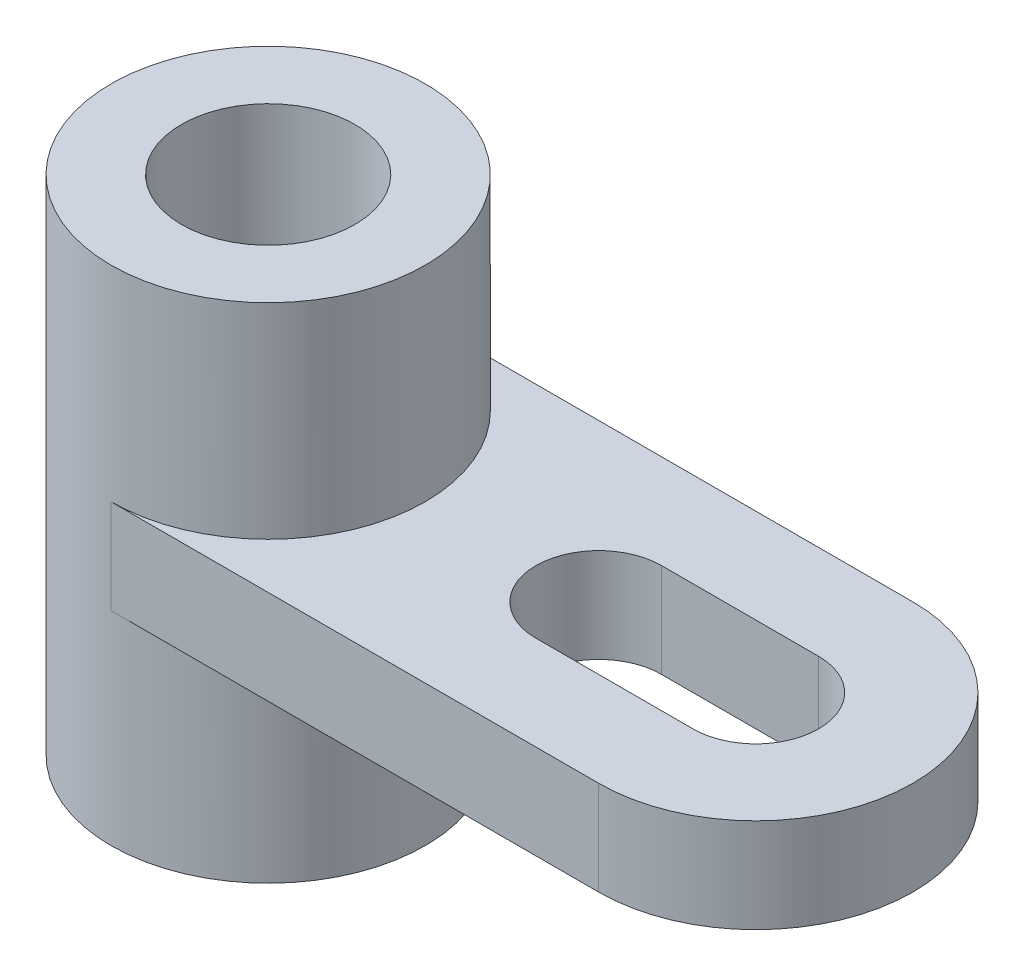
ISO-10303-21;
HEADER;
FILE_DESCRIPTION(('STEP AP214'),'2;1');
FILE_NAME('part.step','',(''),(''),'','','');
FILE_SCHEMA(('AUTOMOTIVE_DESIGN { 1 0 10303 214 1 1 1 1 }'));
ENDSEC;
DATA;
#1=APPLICATION_CONTEXT('core data for automotive mechanical design processes');
#2=APPLICATION_PROTOCOL_DEFINITION('international standard','automotive_design',2000,#1);
#3=PRODUCT_CONTEXT('',#1,'mechanical');
#4=PRODUCT('Part','Part','',(#3));
#5=PRODUCT_RELATED_PRODUCT_CATEGORY('part','',(#4));
#6=PRODUCT_DEFINITION_FORMATION('','',#4);
#7=PRODUCT_DEFINITION_CONTEXT('part definition',#1,'design');
#8=PRODUCT_DEFINITION('design','',#6,#7);
#9=PRODUCT_DEFINITION_SHAPE('','',#8);
#10=(LENGTH_UNIT() NAMED_UNIT(*) SI_UNIT(.MILLI.,.METRE.));
#11=(NAMED_UNIT(*) PLANE_ANGLE_UNIT() SI_UNIT($,.RADIAN.));
#12=(NAMED_UNIT(*) SI_UNIT($,.STERADIAN.) SOLID_ANGLE_UNIT());
#13=UNCERTAINTY_MEASURE_WITH_UNIT(LENGTH_MEASURE(1.E-05),#10,'distance_accuracy_value','');
#14=(GEOMETRIC_REPRESENTATION_CONTEXT(3) GLOBAL_UNCERTAINTY_ASSIGNED_CONTEXT((#13)) GLOBAL_UNIT_ASSIGNED_CONTEXT((#10,
#11,#12)) REPRESENTATION_CONTEXT('',''));
#15=CARTESIAN_POINT('',(0.,0.,0.));
#16=DIRECTION('',(0.,0.,1.));
#17=DIRECTION('',(1.,0.,0.));
#18=AXIS2_PLACEMENT_3D('',#15,#16,#17);
#19=CARTESIAN_POINT('',(49.276,19.05,0.));
#20=DIRECTION('',(0.,-1.,0.));
#21=DIRECTION('',(0.,0.,-1.));
#22=AXIS2_PLACEMENT_3D('',#19,#20,#21);
#23=CYLINDRICAL_SURFACE('',#22,31.75);
#24=CARTESIAN_POINT('',(49.276,0.,0.));
#25=DIRECTION('',(0.,1.,0.));
#26=DIRECTION('',(0.,0.,1.));
#27=AXIS2_PLACEMENT_3D('',#24,#25,#26);
#28=CIRCLE('',#27,31.75);
#29=CARTESIAN_POINT('',(49.276,0.,31.75));
#30=VERTEX_POINT('',#29);
#31=CARTESIAN_POINT('',(49.276,0.,-31.75));
#32=VERTEX_POINT('',#31);
#33=EDGE_CURVE('E120',#30,#32,#28,.T.);
#34=ORIENTED_EDGE('',*,*,#33,.T.);
#35=DIRECTION('',(0.,-1.,0.));
#36=VECTOR('',#35,1.);
#37=CARTESIAN_POINT('',(49.276,19.05,-31.75));
#38=LINE('',#37,#36);
#39=CARTESIAN_POINT('',(49.276,19.05,-31.75));
#40=VERTEX_POINT('',#39);
#41=EDGE_CURVE('E47',#40,#32,#38,.T.);
#42=ORIENTED_EDGE('',*,*,#41,.F.);
#43=CARTESIAN_POINT('',(49.276,19.05,0.));
#44=DIRECTION('',(0.,1.,0.));
#45=DIRECTION('',(0.,0.,1.));
#46=AXIS2_PLACEMENT_3D('',#43,#44,#45);
#47=CIRCLE('',#46,31.75);
#48=CARTESIAN_POINT('',(49.276,19.05,31.75));
#49=VERTEX_POINT('',#48);
#50=EDGE_CURVE('E139',#49,#40,#47,.T.);
#51=ORIENTED_EDGE('',*,*,#50,.F.);
#52=DIRECTION('',(0.,-1.,0.));
#53=VECTOR('',#52,1.);
#54=CARTESIAN_POINT('',(49.276,19.05,31.75));
#55=LINE('',#54,#53);
#56=EDGE_CURVE('E131',#49,#30,#55,.T.);
#57=ORIENTED_EDGE('',*,*,#56,.T.);
#58=EDGE_LOOP('',(#34,#42,#51,#57));
#59=FACE_BOUND('',#58,.T.);
#60=ADVANCED_FACE('F39',(#59),#23,.T.);
#61=CARTESIAN_POINT('',(-49.276,19.05,-31.75));
#62=DIRECTION('',(0.,0.,1.));
#63=DIRECTION('',(1.,0.,0.));
#64=AXIS2_PLACEMENT_3D('',#61,#62,#63);
#65=PLANE('',#64);
#66=DIRECTION('',(-1.,0.,0.));
#67=VECTOR('',#66,1.);
#68=CARTESIAN_POINT('',(-49.276,0.,-31.75));
#69=LINE('',#68,#67);
#70=CARTESIAN_POINT('',(-49.276,0.,-31.75));
#71=VERTEX_POINT('',#70);
#72=EDGE_CURVE('E105',#32,#71,#69,.T.);
#73=ORIENTED_EDGE('',*,*,#72,.T.);
#74=DIRECTION('',(0.,-1.,0.));
#75=VECTOR('',#74,1.);
#76=CARTESIAN_POINT('',(-49.276,19.05,-31.75));
#77=LINE('',#76,#75);
#78=CARTESIAN_POINT('',(-49.276,19.05,-31.75));
#79=VERTEX_POINT('',#78);
#80=EDGE_CURVE('E115',#79,#71,#77,.T.);
#81=ORIENTED_EDGE('',*,*,#80,.F.);
#82=DIRECTION('',(-1.,0.,0.));
#83=VECTOR('',#82,1.);
#84=CARTESIAN_POINT('',(-49.276,19.05,-31.75));
#85=LINE('',#84,#83);
#86=EDGE_CURVE('E146',#40,#79,#85,.T.);
#87=ORIENTED_EDGE('',*,*,#86,.F.);
#88=ORIENTED_EDGE('',*,*,#41,.T.);
#89=EDGE_LOOP('',(#73,#81,#87,#88));
#90=FACE_BOUND('',#89,.T.);
#91=ADVANCED_FACE('F114',(#90),#65,.F.);
#92=CARTESIAN_POINT('',(-49.276,19.05,0.));
#93=DIRECTION('',(0.,-1.,0.));
#94=DIRECTION('',(0.,0.,-1.));
#95=AXIS2_PLACEMENT_3D('',#92,#93,#94);
#96=CYLINDRICAL_SURFACE('',#95,31.75);
#97=ORIENTED_EDGE('',*,*,#80,.T.);
#98=CARTESIAN_POINT('',(-49.2759999999998,0.,0.));
#99=DIRECTION('',(0.,1.,0.));
#100=DIRECTION('',(0.,0.,1.));
#101=AXIS2_PLACEMENT_3D('',#98,#99,#100);
#102=CIRCLE('',#101,31.75);
#103=CARTESIAN_POINT('',(-49.276,0.,31.75));
#104=VERTEX_POINT('',#103);
#105=EDGE_CURVE('E11',#104,#71,#102,.T.);
#106=ORIENTED_EDGE('',*,*,#105,.F.);
#107=DIRECTION('',(0.,-1.,0.));
#108=VECTOR('',#107,1.);
#109=CARTESIAN_POINT('',(-49.276,19.05,31.75));
#110=LINE('',#109,#108);
#111=CARTESIAN_POINT('',(-49.2759999999998,19.05,31.75));
#112=VERTEX_POINT('',#111);
#113=EDGE_CURVE('E127',#112,#104,#110,.T.);
#114=ORIENTED_EDGE('',*,*,#113,.F.);
#115=CARTESIAN_POINT('',(-49.2759999999998,19.05,0.));
#116=DIRECTION('',(0.,1.,0.));
#117=DIRECTION('',(0.,0.,1.));
#118=AXIS2_PLACEMENT_3D('',#115,#116,#117);
#119=CIRCLE('',#118,31.75);
#120=EDGE_CURVE('E125',#112,#79,#119,.T.);
#121=ORIENTED_EDGE('',*,*,#120,.T.);
#122=EDGE_LOOP('',(#97,#106,#114,#121));
#123=FACE_BOUND('',#122,.T.);
#124=CARTESIAN_POINT('',(-49.2759999999998,-41.148,0.));
#125=DIRECTION('',(0.,1.,0.));
#126=DIRECTION('',(0.,0.,1.));
#127=AXIS2_PLACEMENT_3D('',#124,#125,#126);
#128=CIRCLE('',#127,31.75);
#129=CARTESIAN_POINT('',(-49.2759999999998,-41.148,31.75));
#130=VERTEX_POINT('',#129);
#131=EDGE_CURVE('E193',#130,#130,#128,.T.);
#132=ORIENTED_EDGE('',*,*,#131,.T.);
#133=EDGE_LOOP('',(#132));
#134=FACE_BOUND('',#133,.T.);
#135=CARTESIAN_POINT('',(-49.2759999999998,60.452,0.));
#136=DIRECTION('',(0.,1.,0.));
#137=DIRECTION('',(0.,0.,1.));
#138=AXIS2_PLACEMENT_3D('',#135,#136,#137);
#139=CIRCLE('',#138,31.75);
#140=CARTESIAN_POINT('',(-49.2759999999998,60.452,31.75));
#141=VERTEX_POINT('',#140);
#142=EDGE_CURVE('E197',#141,#141,#139,.T.);
#143=ORIENTED_EDGE('',*,*,#142,.F.);
#144=EDGE_LOOP('',(#143));
#145=FACE_BOUND('',#144,.T.);
#146=ADVANCED_FACE('F122',(#123,#134,#145),#96,.T.);
#147=CARTESIAN_POINT('',(-49.276,19.05,31.75));
#148=DIRECTION('',(0.,0.,-1.));
#149=DIRECTION('',(-1.,0.,0.));
#150=AXIS2_PLACEMENT_3D('',#147,#148,#149);
#151=PLANE('',#150);
#152=DIRECTION('',(1.,0.,0.));
#153=VECTOR('',#152,1.);
#154=CARTESIAN_POINT('',(-49.276,0.,31.75));
#155=LINE('',#154,#153);
#156=EDGE_CURVE('E107',#104,#30,#155,.T.);
#157=ORIENTED_EDGE('',*,*,#156,.T.);
#158=ORIENTED_EDGE('',*,*,#56,.F.);
#159=DIRECTION('',(1.,0.,0.));
#160=VECTOR('',#159,1.);
#161=CARTESIAN_POINT('',(-49.276,19.05,31.75));
#162=LINE('',#161,#160);
#163=EDGE_CURVE('E137',#112,#49,#162,.T.);
#164=ORIENTED_EDGE('',*,*,#163,.F.);
#165=ORIENTED_EDGE('',*,*,#113,.T.);
#166=EDGE_LOOP('',(#157,#158,#164,#165));
#167=FACE_BOUND('',#166,.T.);
#168=ADVANCED_FACE('F226',(#167),#151,.F.);
#169=CARTESIAN_POINT('',(49.276,19.05,0.));
#170=DIRECTION('',(0.,1.,0.));
#171=DIRECTION('',(0.,0.,1.));
#172=AXIS2_PLACEMENT_3D('',#169,#170,#171);
#173=PLANE('',#172);
#174=ORIENTED_EDGE('',*,*,#120,.F.);
#175=ORIENTED_EDGE('',*,*,#163,.T.);
#176=ORIENTED_EDGE('',*,*,#50,.T.);
#177=ORIENTED_EDGE('',*,*,#86,.T.);
#178=EDGE_LOOP('',(#174,#175,#176,#177));
#179=FACE_BOUND('',#178,.T.);
#180=CARTESIAN_POINT('',(49.276,19.05,0.));
#181=DIRECTION('',(0.,-1.,0.));
#182=DIRECTION('',(0.,0.,-1.));
#183=AXIS2_PLACEMENT_3D('',#180,#181,#182);
#184=CIRCLE('',#183,12.7);
#185=CARTESIAN_POINT('',(49.276,19.05,-12.7));
#186=VERTEX_POINT('',#185);
#187=CARTESIAN_POINT('',(49.276,19.05,12.7));
#188=VERTEX_POINT('',#187);
#189=EDGE_CURVE('E168',#186,#188,#184,.T.);
#190=ORIENTED_EDGE('',*,*,#189,.T.);
#191=DIRECTION('',(-1.,0.,0.));
#192=VECTOR('',#191,1.);
#193=CARTESIAN_POINT('',(17.526,19.05,12.7));
#194=LINE('',#193,#192);
#195=CARTESIAN_POINT('',(17.526,19.05,12.7));
#196=VERTEX_POINT('',#195);
#197=EDGE_CURVE('E184',#188,#196,#194,.T.);
#198=ORIENTED_EDGE('',*,*,#197,.T.);
#199=CARTESIAN_POINT('',(17.526,19.05,0.));
#200=DIRECTION('',(0.,-1.,0.));
#201=DIRECTION('',(0.,0.,-1.));
#202=AXIS2_PLACEMENT_3D('',#199,#200,#201);
#203=CIRCLE('',#202,12.7);
#204=CARTESIAN_POINT('',(17.526,19.05,-12.7));
#205=VERTEX_POINT('',#204);
#206=EDGE_CURVE('E54',#196,#205,#203,.T.);
#207=ORIENTED_EDGE('',*,*,#206,.T.);
#208=DIRECTION('',(1.,0.,0.));
#209=VECTOR('',#208,1.);
#210=CARTESIAN_POINT('',(17.526,19.05,-12.7));
#211=LINE('',#210,#209);
#212=EDGE_CURVE('E156',#205,#186,#211,.T.);
#213=ORIENTED_EDGE('',*,*,#212,.T.);
#214=EDGE_LOOP('',(#190,#198,#207,#213));
#215=FACE_BOUND('',#214,.T.);
#216=ADVANCED_FACE('F232',(#179,#215),#173,.T.);
#217=CARTESIAN_POINT('',(49.276,0.,0.));
#218=DIRECTION('',(0.,1.,0.));
#219=DIRECTION('',(0.,0.,1.));
#220=AXIS2_PLACEMENT_3D('',#217,#218,#219);
#221=PLANE('',#220);
#222=DIRECTION('',(-1.,0.,0.));
#223=VECTOR('',#222,1.);
#224=CARTESIAN_POINT('',(17.526,0.,12.7));
#225=LINE('',#224,#223);
#226=CARTESIAN_POINT('',(49.276,0.,12.7));
#227=VERTEX_POINT('',#226);
#228=CARTESIAN_POINT('',(17.526,0.,12.7));
#229=VERTEX_POINT('',#228);
#230=EDGE_CURVE('E173',#227,#229,#225,.T.);
#231=ORIENTED_EDGE('',*,*,#230,.F.);
#232=CARTESIAN_POINT('',(49.276,0.,0.));
#233=DIRECTION('',(0.,-1.,0.));
#234=DIRECTION('',(0.,0.,-1.));
#235=AXIS2_PLACEMENT_3D('',#232,#233,#234);
#236=CIRCLE('',#235,12.7);
#237=CARTESIAN_POINT('',(49.276,0.,-12.7));
#238=VERTEX_POINT('',#237);
#239=EDGE_CURVE('E62',#238,#227,#236,.T.);
#240=ORIENTED_EDGE('',*,*,#239,.F.);
#241=DIRECTION('',(1.,0.,0.));
#242=VECTOR('',#241,1.);
#243=CARTESIAN_POINT('',(17.526,0.,-12.7));
#244=LINE('',#243,#242);
#245=CARTESIAN_POINT('',(17.526,0.,-12.7));
#246=VERTEX_POINT('',#245);
#247=EDGE_CURVE('E164',#246,#238,#244,.T.);
#248=ORIENTED_EDGE('',*,*,#247,.F.);
#249=CARTESIAN_POINT('',(17.526,0.,0.));
#250=DIRECTION('',(0.,-1.,0.));
#251=DIRECTION('',(0.,0.,-1.));
#252=AXIS2_PLACEMENT_3D('',#249,#250,#251);
#253=CIRCLE('',#252,12.7);
#254=EDGE_CURVE('E169',#229,#246,#253,.T.);
#255=ORIENTED_EDGE('',*,*,#254,.F.);
#256=EDGE_LOOP('',(#231,#240,#248,#255));
#257=FACE_BOUND('',#256,.T.);
#258=ORIENTED_EDGE('',*,*,#156,.F.);
#259=ORIENTED_EDGE('',*,*,#105,.T.);
#260=ORIENTED_EDGE('',*,*,#72,.F.);
#261=ORIENTED_EDGE('',*,*,#33,.F.);
#262=EDGE_LOOP('',(#258,#259,#260,#261));
#263=FACE_BOUND('',#262,.T.);
#264=ADVANCED_FACE('F103',(#257,#263),#221,.F.);
#265=CARTESIAN_POINT('',(49.276,19.05,0.));
#266=DIRECTION('',(0.,-1.,0.));
#267=DIRECTION('',(0.,0.,-1.));
#268=AXIS2_PLACEMENT_3D('',#265,#266,#267);
#269=CYLINDRICAL_SURFACE('',#268,12.7);
#270=ORIENTED_EDGE('',*,*,#239,.T.);
#271=DIRECTION('',(0.,-1.,0.));
#272=VECTOR('',#271,1.);
#273=CARTESIAN_POINT('',(49.276,19.05,12.7));
#274=LINE('',#273,#272);
#275=EDGE_CURVE('E152',#188,#227,#274,.T.);
#276=ORIENTED_EDGE('',*,*,#275,.F.);
#277=ORIENTED_EDGE('',*,*,#189,.F.);
#278=DIRECTION('',(0.,-1.,0.));
#279=VECTOR('',#278,1.);
#280=CARTESIAN_POINT('',(49.276,19.05,-12.7));
#281=LINE('',#280,#279);
#282=EDGE_CURVE('E143',#186,#238,#281,.T.);
#283=ORIENTED_EDGE('',*,*,#282,.T.);
#284=EDGE_LOOP('',(#270,#276,#277,#283));
#285=FACE_BOUND('',#284,.T.);
#286=ADVANCED_FACE('F248',(#285),#269,.F.);
#287=CARTESIAN_POINT('',(17.526,19.05,-12.7));
#288=DIRECTION('',(0.,0.,-1.));
#289=DIRECTION('',(-1.,0.,0.));
#290=AXIS2_PLACEMENT_3D('',#287,#288,#289);
#291=PLANE('',#290);
#292=ORIENTED_EDGE('',*,*,#247,.T.);
#293=ORIENTED_EDGE('',*,*,#282,.F.);
#294=ORIENTED_EDGE('',*,*,#212,.F.);
#295=DIRECTION('',(0.,-1.,0.));
#296=VECTOR('',#295,1.);
#297=CARTESIAN_POINT('',(17.526,19.05,-12.7));
#298=LINE('',#297,#296);
#299=EDGE_CURVE('E159',#205,#246,#298,.T.);
#300=ORIENTED_EDGE('',*,*,#299,.T.);
#301=EDGE_LOOP('',(#292,#293,#294,#300));
#302=FACE_BOUND('',#301,.T.);
#303=ADVANCED_FACE('F257',(#302),#291,.F.);
#304=CARTESIAN_POINT('',(17.526,19.05,0.));
#305=DIRECTION('',(0.,-1.,0.));
#306=DIRECTION('',(0.,0.,-1.));
#307=AXIS2_PLACEMENT_3D('',#304,#305,#306);
#308=CYLINDRICAL_SURFACE('',#307,12.7);
#309=ORIENTED_EDGE('',*,*,#254,.T.);
#310=ORIENTED_EDGE('',*,*,#299,.F.);
#311=ORIENTED_EDGE('',*,*,#206,.F.);
#312=DIRECTION('',(0.,-1.,0.));
#313=VECTOR('',#312,1.);
#314=CARTESIAN_POINT('',(17.526,19.05,12.7));
#315=LINE('',#314,#313);
#316=EDGE_CURVE('E155',#196,#229,#315,.T.);
#317=ORIENTED_EDGE('',*,*,#316,.T.);
#318=EDGE_LOOP('',(#309,#310,#311,#317));
#319=FACE_BOUND('',#318,.T.);
#320=ADVANCED_FACE('F253',(#319),#308,.F.);
#321=CARTESIAN_POINT('',(17.526,19.05,12.7));
#322=DIRECTION('',(0.,0.,1.));
#323=DIRECTION('',(1.,0.,0.));
#324=AXIS2_PLACEMENT_3D('',#321,#322,#323);
#325=PLANE('',#324);
#326=ORIENTED_EDGE('',*,*,#230,.T.);
#327=ORIENTED_EDGE('',*,*,#316,.F.);
#328=ORIENTED_EDGE('',*,*,#197,.F.);
#329=ORIENTED_EDGE('',*,*,#275,.T.);
#330=EDGE_LOOP('',(#326,#327,#328,#329));
#331=FACE_BOUND('',#330,.T.);
#332=ADVANCED_FACE('F251',(#331),#325,.F.);
#333=CARTESIAN_POINT('',(-49.2759999999998,-41.148,0.));
#334=DIRECTION('',(0.,1.,0.));
#335=DIRECTION('',(0.,0.,1.));
#336=AXIS2_PLACEMENT_3D('',#333,#334,#335);
#337=PLANE('',#336);
#338=CARTESIAN_POINT('',(-49.2759999999999,-41.148,0.));
#339=DIRECTION('',(0.,1.,0.));
#340=DIRECTION('',(0.,0.,1.));
#341=AXIS2_PLACEMENT_3D('',#338,#339,#340);
#342=CIRCLE('',#341,17.526);
#343=CARTESIAN_POINT('',(-49.2759999999999,-41.148,17.526));
#344=VERTEX_POINT('',#343);
#345=EDGE_CURVE('E201',#344,#344,#342,.T.);
#346=ORIENTED_EDGE('',*,*,#345,.T.);
#347=EDGE_LOOP('',(#346));
#348=FACE_BOUND('',#347,.T.);
#349=ORIENTED_EDGE('',*,*,#131,.F.);
#350=EDGE_LOOP('',(#349));
#351=FACE_BOUND('',#350,.T.);
#352=ADVANCED_FACE('F210',(#348,#351),#337,.F.);
#353=CARTESIAN_POINT('',(-49.2759999999998,60.452,0.));
#354=DIRECTION('',(0.,1.,0.));
#355=DIRECTION('',(0.,0.,1.));
#356=AXIS2_PLACEMENT_3D('',#353,#354,#355);
#357=PLANE('',#356);
#358=CARTESIAN_POINT('',(-49.2759999999999,60.452,0.));
#359=DIRECTION('',(0.,1.,0.));
#360=DIRECTION('',(0.,0.,1.));
#361=AXIS2_PLACEMENT_3D('',#358,#359,#360);
#362=CIRCLE('',#361,17.526);
#363=CARTESIAN_POINT('',(-49.2759999999999,60.452,17.526));
#364=VERTEX_POINT('',#363);
#365=EDGE_CURVE('E202',#364,#364,#362,.T.);
#366=ORIENTED_EDGE('',*,*,#365,.F.);
#367=EDGE_LOOP('',(#366));
#368=FACE_BOUND('',#367,.T.);
#369=ORIENTED_EDGE('',*,*,#142,.T.);
#370=EDGE_LOOP('',(#369));
#371=FACE_BOUND('',#370,.T.);
#372=ADVANCED_FACE('F216',(#368,#371),#357,.T.);
#373=CARTESIAN_POINT('',(-49.2759999999999,-41.148,0.));
#374=DIRECTION('',(0.,1.,0.));
#375=DIRECTION('',(0.,0.,1.));
#376=AXIS2_PLACEMENT_3D('',#373,#374,#375);
#377=CYLINDRICAL_SURFACE('',#376,17.526);
#378=ORIENTED_EDGE('',*,*,#345,.F.);
#379=EDGE_LOOP('',(#378));
#380=FACE_BOUND('',#379,.T.);
#381=ORIENTED_EDGE('',*,*,#365,.T.);
#382=EDGE_LOOP('',(#381));
#383=FACE_BOUND('',#382,.T.);
#384=ADVANCED_FACE('F213',(#380,#383),#377,.F.);
#385=CLOSED_SHELL('',(#60,#91,#146,#168,#216,#264,#286,#303,#320,#332,#352,#372,#384));
#386=MANIFOLD_SOLID_BREP('B2',#385);
#387=ADVANCED_BREP_SHAPE_REPRESENTATION('',(#18,#386),#14);
#388=SHAPE_DEFINITION_REPRESENTATION(#9,#387);
ENDSEC;
END-ISO-10303-21;
